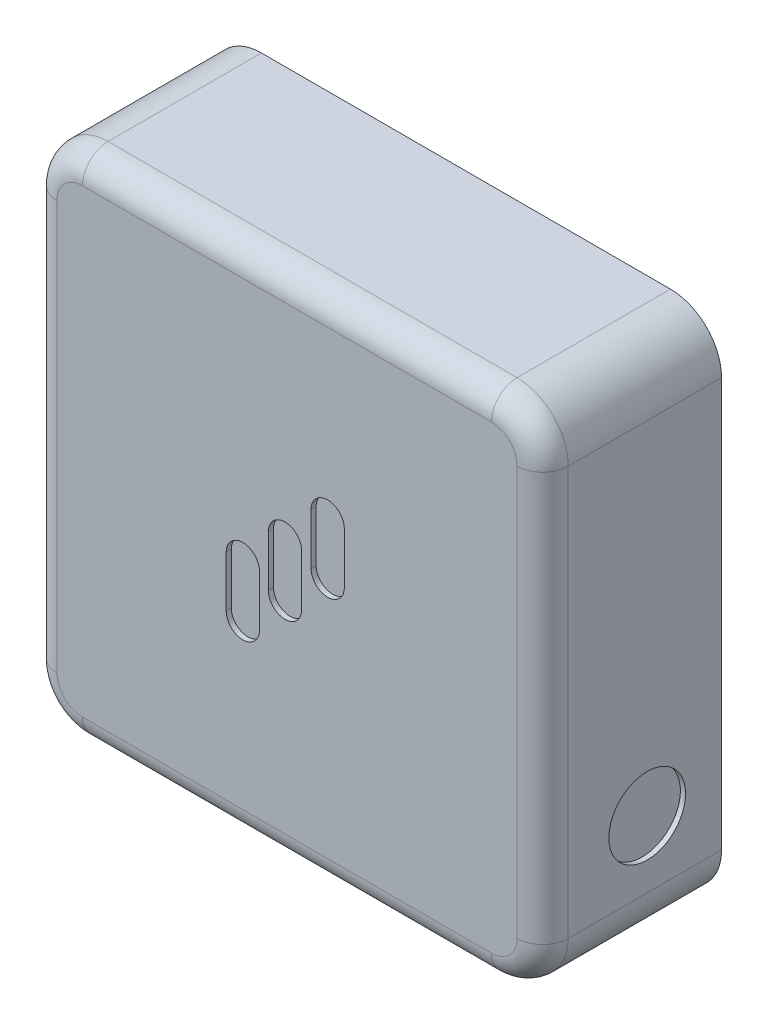
ISO-10303-21;
HEADER;
FILE_DESCRIPTION(('STEP AP214'),'2;1');
FILE_NAME('part.step','',(''),(''),'','','');
FILE_SCHEMA(('AUTOMOTIVE_DESIGN { 1 0 10303 214 1 1 1 1 }'));
ENDSEC;
DATA;
#1=APPLICATION_CONTEXT('core data for automotive mechanical design processes');
#2=APPLICATION_PROTOCOL_DEFINITION('international standard','automotive_design',2000,#1);
#3=PRODUCT_CONTEXT('',#1,'mechanical');
#4=PRODUCT('Part','Part','',(#3));
#5=PRODUCT_RELATED_PRODUCT_CATEGORY('part','',(#4));
#6=PRODUCT_DEFINITION_FORMATION('','',#4);
#7=PRODUCT_DEFINITION_CONTEXT('part definition',#1,'design');
#8=PRODUCT_DEFINITION('design','',#6,#7);
#9=PRODUCT_DEFINITION_SHAPE('','',#8);
#10=(LENGTH_UNIT() NAMED_UNIT(*) SI_UNIT(.MILLI.,.METRE.));
#11=(NAMED_UNIT(*) PLANE_ANGLE_UNIT() SI_UNIT($,.RADIAN.));
#12=(NAMED_UNIT(*) SI_UNIT($,.STERADIAN.) SOLID_ANGLE_UNIT());
#13=UNCERTAINTY_MEASURE_WITH_UNIT(LENGTH_MEASURE(1.E-05),#10,'distance_accuracy_value','');
#14=(GEOMETRIC_REPRESENTATION_CONTEXT(3) GLOBAL_UNCERTAINTY_ASSIGNED_CONTEXT((#13)) GLOBAL_UNIT_ASSIGNED_CONTEXT((#10,
#11,#12)) REPRESENTATION_CONTEXT('',''));
#15=CARTESIAN_POINT('',(0.,0.,0.));
#16=DIRECTION('',(0.,0.,1.));
#17=DIRECTION('',(1.,0.,0.));
#18=AXIS2_PLACEMENT_3D('',#15,#16,#17);
#19=CARTESIAN_POINT('',(-57.3786149605487,26.1554150628127,35.));
#20=DIRECTION('',(1.,0.,0.));
#21=DIRECTION('',(0.,1.,0.));
#22=AXIS2_PLACEMENT_3D('',#19,#20,#21);
#23=PLANE('',#22);
#24=DIRECTION('',(0.,0.,-1.));
#25=VECTOR('',#24,1.);
#26=CARTESIAN_POINT('',(-57.3786149605487,-63.8445849371873,35.));
#27=LINE('',#26,#25);
#28=CARTESIAN_POINT('',(-57.3786149605487,-63.8445849371873,0.));
#29=VERTEX_POINT('',#28);
#30=CARTESIAN_POINT('',(-57.3786149605487,-63.8445849371873,30.));
#31=VERTEX_POINT('',#30);
#32=EDGE_CURVE('E394',#29,#31,#27,.F.);
#33=ORIENTED_EDGE('',*,*,#32,.T.);
#34=DIRECTION('',(0.,-1.,0.));
#35=VECTOR('',#34,1.);
#36=CARTESIAN_POINT('',(-57.3786149605487,16.1554150628127,30.));
#37=LINE('',#36,#35);
#38=CARTESIAN_POINT('',(-57.3786149605487,16.1554150628127,30.));
#39=VERTEX_POINT('',#38);
#40=EDGE_CURVE('E434',#31,#39,#37,.F.);
#41=ORIENTED_EDGE('',*,*,#40,.T.);
#42=DIRECTION('',(0.,0.,-1.));
#43=VECTOR('',#42,1.);
#44=CARTESIAN_POINT('',(-57.3786149605487,16.1554150628127,0.));
#45=LINE('',#44,#43);
#46=CARTESIAN_POINT('',(-57.3786149605487,16.1554150628127,0.));
#47=VERTEX_POINT('',#46);
#48=EDGE_CURVE('E391',#39,#47,#45,.T.);
#49=ORIENTED_EDGE('',*,*,#48,.T.);
#50=DIRECTION('',(0.,-1.,0.));
#51=VECTOR('',#50,1.);
#52=CARTESIAN_POINT('',(-57.3786149605487,26.1554150628127,0.));
#53=LINE('',#52,#51);
#54=EDGE_CURVE('E349',#47,#29,#53,.T.);
#55=ORIENTED_EDGE('',*,*,#54,.T.);
#56=EDGE_LOOP('',(#33,#41,#49,#55));
#57=FACE_BOUND('',#56,.T.);
#58=ADVANCED_FACE('F41',(#57),#23,.F.);
#59=CARTESIAN_POINT('',(-57.3786149605487,-73.8445849371873,35.));
#60=DIRECTION('',(0.,1.,0.));
#61=DIRECTION('',(0.,0.,1.));
#62=AXIS2_PLACEMENT_3D('',#59,#60,#61);
#63=PLANE('',#62);
#64=DIRECTION('',(0.,0.,-1.));
#65=VECTOR('',#64,1.);
#66=CARTESIAN_POINT('',(32.6213850394513,-73.8445849371873,35.));
#67=LINE('',#66,#65);
#68=CARTESIAN_POINT('',(32.6213850394513,-73.8445849371873,0.));
#69=VERTEX_POINT('',#68);
#70=CARTESIAN_POINT('',(32.6213850394513,-73.8445849371873,30.));
#71=VERTEX_POINT('',#70);
#72=EDGE_CURVE('E387',#69,#71,#67,.F.);
#73=ORIENTED_EDGE('',*,*,#72,.T.);
#74=DIRECTION('',(1.,0.,0.));
#75=VECTOR('',#74,1.);
#76=CARTESIAN_POINT('',(-47.3786149605487,-73.8445849371873,30.));
#77=LINE('',#76,#75);
#78=CARTESIAN_POINT('',(-47.3786149605487,-73.8445849371873,30.));
#79=VERTEX_POINT('',#78);
#80=EDGE_CURVE('E11',#71,#79,#77,.F.);
#81=ORIENTED_EDGE('',*,*,#80,.T.);
#82=DIRECTION('',(0.,0.,-1.));
#83=VECTOR('',#82,1.);
#84=CARTESIAN_POINT('',(-47.3786149605487,-73.8445849371873,35.));
#85=LINE('',#84,#83);
#86=CARTESIAN_POINT('',(-47.3786149605487,-73.8445849371873,0.));
#87=VERTEX_POINT('',#86);
#88=EDGE_CURVE('E384',#79,#87,#85,.T.);
#89=ORIENTED_EDGE('',*,*,#88,.T.);
#90=DIRECTION('',(1.,0.,0.));
#91=VECTOR('',#90,1.);
#92=CARTESIAN_POINT('',(-57.3786149605487,-73.8445849371873,0.));
#93=LINE('',#92,#91);
#94=EDGE_CURVE('E353',#87,#69,#93,.T.);
#95=ORIENTED_EDGE('',*,*,#94,.T.);
#96=EDGE_LOOP('',(#73,#81,#89,#95));
#97=FACE_BOUND('',#96,.T.);
#98=ADVANCED_FACE('F536',(#97),#63,.F.);
#99=CARTESIAN_POINT('',(42.6213850394513,26.1554150628127,35.));
#100=DIRECTION('',(1.,0.,0.));
#101=DIRECTION('',(0.,1.,0.));
#102=AXIS2_PLACEMENT_3D('',#99,#100,#101);
#103=PLANE('',#102);
#104=CARTESIAN_POINT('',(42.6213850394513,-50.7845466337328,14.5503691573125));
#105=DIRECTION('',(1.,0.,0.));
#106=DIRECTION('',(0.,1.,0.));
#107=AXIS2_PLACEMENT_3D('',#104,#105,#106);
#108=CIRCLE('',#107,7.5);
#109=CARTESIAN_POINT('',(42.6213850394513,-43.2845466337328,14.5503691573125));
#110=VERTEX_POINT('',#109);
#111=EDGE_CURVE('E250',#110,#110,#108,.T.);
#112=ORIENTED_EDGE('',*,*,#111,.F.);
#113=EDGE_LOOP('',(#112));
#114=FACE_BOUND('',#113,.T.);
#115=DIRECTION('',(0.,0.,-1.));
#116=VECTOR('',#115,1.);
#117=CARTESIAN_POINT('',(42.6213850394513,16.1554150628127,35.));
#118=LINE('',#117,#116);
#119=CARTESIAN_POINT('',(42.6213850394513,16.1554150628127,0.));
#120=VERTEX_POINT('',#119);
#121=CARTESIAN_POINT('',(42.6213850394513,16.1554150628127,30.));
#122=VERTEX_POINT('',#121);
#123=EDGE_CURVE('E365',#120,#122,#118,.F.);
#124=ORIENTED_EDGE('',*,*,#123,.T.);
#125=DIRECTION('',(0.,-1.,0.));
#126=VECTOR('',#125,1.);
#127=CARTESIAN_POINT('',(42.6213850394513,26.1554150628127,30.));
#128=LINE('',#127,#126);
#129=CARTESIAN_POINT('',(42.6213850394513,-63.8445849371873,30.));
#130=VERTEX_POINT('',#129);
#131=EDGE_CURVE('E446',#122,#130,#128,.T.);
#132=ORIENTED_EDGE('',*,*,#131,.T.);
#133=DIRECTION('',(0.,0.,-1.));
#134=VECTOR('',#133,1.);
#135=CARTESIAN_POINT('',(42.6213850394513,-63.8445849371873,0.));
#136=LINE('',#135,#134);
#137=CARTESIAN_POINT('',(42.6213850394513,-63.8445849371873,0.));
#138=VERTEX_POINT('',#137);
#139=EDGE_CURVE('E369',#130,#138,#136,.T.);
#140=ORIENTED_EDGE('',*,*,#139,.T.);
#141=DIRECTION('',(0.,-1.,0.));
#142=VECTOR('',#141,1.);
#143=CARTESIAN_POINT('',(42.6213850394513,26.1554150628127,0.));
#144=LINE('',#143,#142);
#145=EDGE_CURVE('E357',#120,#138,#144,.T.);
#146=ORIENTED_EDGE('',*,*,#145,.F.);
#147=EDGE_LOOP('',(#124,#132,#140,#146));
#148=FACE_BOUND('',#147,.T.);
#149=ADVANCED_FACE('F496',(#114,#148),#103,.T.);
#150=CARTESIAN_POINT('',(-57.3786149605487,26.1554150628127,35.));
#151=DIRECTION('',(0.,1.,0.));
#152=DIRECTION('',(0.,0.,1.));
#153=AXIS2_PLACEMENT_3D('',#150,#151,#152);
#154=PLANE('',#153);
#155=DIRECTION('',(0.,0.,-1.));
#156=VECTOR('',#155,1.);
#157=CARTESIAN_POINT('',(-47.3786149605487,26.1554150628127,35.));
#158=LINE('',#157,#156);
#159=CARTESIAN_POINT('',(-47.3786149605487,26.1554150628127,0.));
#160=VERTEX_POINT('',#159);
#161=CARTESIAN_POINT('',(-47.3786149605487,26.1554150628127,30.));
#162=VERTEX_POINT('',#161);
#163=EDGE_CURVE('E401',#160,#162,#158,.F.);
#164=ORIENTED_EDGE('',*,*,#163,.T.);
#165=DIRECTION('',(1.,0.,0.));
#166=VECTOR('',#165,1.);
#167=CARTESIAN_POINT('',(-57.3786149605487,26.1554150628127,30.));
#168=LINE('',#167,#166);
#169=CARTESIAN_POINT('',(32.6213850394513,26.1554150628127,30.));
#170=VERTEX_POINT('',#169);
#171=EDGE_CURVE('E440',#162,#170,#168,.T.);
#172=ORIENTED_EDGE('',*,*,#171,.T.);
#173=DIRECTION('',(0.,0.,-1.));
#174=VECTOR('',#173,1.);
#175=CARTESIAN_POINT('',(32.6213850394513,26.1554150628127,35.));
#176=LINE('',#175,#174);
#177=CARTESIAN_POINT('',(32.6213850394513,26.1554150628127,0.));
#178=VERTEX_POINT('',#177);
#179=EDGE_CURVE('E398',#170,#178,#176,.T.);
#180=ORIENTED_EDGE('',*,*,#179,.T.);
#181=DIRECTION('',(1.,0.,0.));
#182=VECTOR('',#181,1.);
#183=CARTESIAN_POINT('',(-57.3786149605487,26.1554150628127,0.));
#184=LINE('',#183,#182);
#185=EDGE_CURVE('E361',#160,#178,#184,.T.);
#186=ORIENTED_EDGE('',*,*,#185,.F.);
#187=EDGE_LOOP('',(#164,#172,#180,#186));
#188=FACE_BOUND('',#187,.T.);
#189=ADVANCED_FACE('F507',(#188),#154,.T.);
#190=CARTESIAN_POINT('',(0.,0.,35.));
#191=DIRECTION('',(0.,0.,1.));
#192=DIRECTION('',(1.,0.,0.));
#193=AXIS2_PLACEMENT_3D('',#190,#191,#192);
#194=PLANE('',#193);
#195=CARTESIAN_POINT('',(-16.0178897561953,-36.8220618232502,35.));
#196=DIRECTION('',(0.,0.,1.));
#197=DIRECTION('',(1.,0.,0.));
#198=AXIS2_PLACEMENT_3D('',#195,#196,#197);
#199=CIRCLE('',#198,3.25587240874136);
#200=CARTESIAN_POINT('',(-19.2737621649367,-36.8220618232502,35.));
#201=VERTEX_POINT('',#200);
#202=CARTESIAN_POINT('',(-12.762017347454,-36.8220618232502,35.));
#203=VERTEX_POINT('',#202);
#204=EDGE_CURVE('E59',#201,#203,#199,.T.);
#205=ORIENTED_EDGE('',*,*,#204,.F.);
#206=DIRECTION('',(0.,-1.,0.));
#207=VECTOR('',#206,1.);
#208=CARTESIAN_POINT('',(-19.2737621649367,-36.8220618232502,35.));
#209=LINE('',#208,#207);
#210=CARTESIAN_POINT('',(-19.2737621649367,-26.8511288793585,35.));
#211=VERTEX_POINT('',#210);
#212=EDGE_CURVE('E227',#211,#201,#209,.T.);
#213=ORIENTED_EDGE('',*,*,#212,.F.);
#214=CARTESIAN_POINT('',(-16.0178897561953,-26.8511288793585,35.));
#215=DIRECTION('',(0.,0.,1.));
#216=DIRECTION('',(1.,0.,0.));
#217=AXIS2_PLACEMENT_3D('',#214,#215,#216);
#218=CIRCLE('',#217,3.25587240874137);
#219=CARTESIAN_POINT('',(-12.762017347454,-26.8511288793585,35.));
#220=VERTEX_POINT('',#219);
#221=EDGE_CURVE('E231',#220,#211,#218,.T.);
#222=ORIENTED_EDGE('',*,*,#221,.F.);
#223=DIRECTION('',(0.,1.,0.));
#224=VECTOR('',#223,1.);
#225=CARTESIAN_POINT('',(-12.762017347454,-36.8220618232502,35.));
#226=LINE('',#225,#224);
#227=EDGE_CURVE('E240',#203,#220,#226,.T.);
#228=ORIENTED_EDGE('',*,*,#227,.F.);
#229=EDGE_LOOP('',(#205,#213,#222,#228));
#230=FACE_BOUND('',#229,.T.);
#231=CARTESIAN_POINT('',(-7.77189907290697,-29.2242948910743,35.));
#232=DIRECTION('',(0.,0.,1.));
#233=DIRECTION('',(1.,0.,0.));
#234=AXIS2_PLACEMENT_3D('',#231,#232,#233);
#235=CIRCLE('',#234,3.25587240874136);
#236=CARTESIAN_POINT('',(-11.0277714816483,-29.2242948910743,35.));
#237=VERTEX_POINT('',#236);
#238=CARTESIAN_POINT('',(-4.51602666416561,-29.2242948910743,35.));
#239=VERTEX_POINT('',#238);
#240=EDGE_CURVE('E67',#237,#239,#235,.T.);
#241=ORIENTED_EDGE('',*,*,#240,.F.);
#242=DIRECTION('',(0.,-1.,0.));
#243=VECTOR('',#242,1.);
#244=CARTESIAN_POINT('',(-11.0277714816483,-29.2242948910743,35.));
#245=LINE('',#244,#243);
#246=CARTESIAN_POINT('',(-11.0277714816483,-19.2533619471825,35.));
#247=VERTEX_POINT('',#246);
#248=EDGE_CURVE('E261',#247,#237,#245,.T.);
#249=ORIENTED_EDGE('',*,*,#248,.F.);
#250=CARTESIAN_POINT('',(-7.77189907290697,-19.2533619471825,35.));
#251=DIRECTION('',(0.,0.,1.));
#252=DIRECTION('',(1.,0.,0.));
#253=AXIS2_PLACEMENT_3D('',#250,#251,#252);
#254=CIRCLE('',#253,3.25587240874136);
#255=CARTESIAN_POINT('',(-4.51602666416561,-19.2533619471825,35.));
#256=VERTEX_POINT('',#255);
#257=EDGE_CURVE('E281',#256,#247,#254,.T.);
#258=ORIENTED_EDGE('',*,*,#257,.F.);
#259=DIRECTION('',(0.,1.,0.));
#260=VECTOR('',#259,1.);
#261=CARTESIAN_POINT('',(-4.51602666416561,-29.2242948910743,35.));
#262=LINE('',#261,#260);
#263=EDGE_CURVE('E276',#239,#256,#262,.T.);
#264=ORIENTED_EDGE('',*,*,#263,.F.);
#265=EDGE_LOOP('',(#241,#249,#258,#264));
#266=FACE_BOUND('',#265,.T.);
#267=CARTESIAN_POINT('',(0.574131194479374,-21.3115149364212,35.));
#268=DIRECTION('',(0.,0.,1.));
#269=DIRECTION('',(1.,0.,0.));
#270=AXIS2_PLACEMENT_3D('',#267,#268,#269);
#271=CIRCLE('',#270,3.25587240874137);
#272=CARTESIAN_POINT('',(-2.681741214262,-21.3115149364212,35.));
#273=VERTEX_POINT('',#272);
#274=CARTESIAN_POINT('',(3.83000360322075,-21.3115149364212,35.));
#275=VERTEX_POINT('',#274);
#276=EDGE_CURVE('E316',#273,#275,#271,.T.);
#277=ORIENTED_EDGE('',*,*,#276,.F.);
#278=DIRECTION('',(0.,-1.,0.));
#279=VECTOR('',#278,1.);
#280=CARTESIAN_POINT('',(-2.681741214262,-21.3115149364212,35.));
#281=LINE('',#280,#279);
#282=CARTESIAN_POINT('',(-2.681741214262,-11.3405819925295,35.));
#283=VERTEX_POINT('',#282);
#284=EDGE_CURVE('E303',#283,#273,#281,.T.);
#285=ORIENTED_EDGE('',*,*,#284,.F.);
#286=CARTESIAN_POINT('',(0.574131194479374,-11.3405819925295,35.));
#287=DIRECTION('',(0.,0.,1.));
#288=DIRECTION('',(1.,0.,0.));
#289=AXIS2_PLACEMENT_3D('',#286,#287,#288);
#290=CIRCLE('',#289,3.25587240874137);
#291=CARTESIAN_POINT('',(3.83000360322075,-11.3405819925295,35.));
#292=VERTEX_POINT('',#291);
#293=EDGE_CURVE('E323',#292,#283,#290,.T.);
#294=ORIENTED_EDGE('',*,*,#293,.F.);
#295=DIRECTION('',(0.,1.,0.));
#296=VECTOR('',#295,1.);
#297=CARTESIAN_POINT('',(3.83000360322075,-21.3115149364212,35.));
#298=LINE('',#297,#296);
#299=EDGE_CURVE('E319',#275,#292,#298,.T.);
#300=ORIENTED_EDGE('',*,*,#299,.F.);
#301=EDGE_LOOP('',(#277,#285,#294,#300));
#302=FACE_BOUND('',#301,.T.);
#303=DIRECTION('',(0.,-1.,0.));
#304=VECTOR('',#303,1.);
#305=CARTESIAN_POINT('',(-52.3786149605487,-63.8445849371873,35.));
#306=LINE('',#305,#304);
#307=CARTESIAN_POINT('',(-52.3786149605487,16.1554150628127,35.));
#308=VERTEX_POINT('',#307);
#309=CARTESIAN_POINT('',(-52.3786149605487,-63.8445849371873,35.));
#310=VERTEX_POINT('',#309);
#311=EDGE_CURVE('E423',#308,#310,#306,.T.);
#312=ORIENTED_EDGE('',*,*,#311,.T.);
#313=CARTESIAN_POINT('',(-47.3786149605487,-63.8445849371873,35.));
#314=DIRECTION('',(0.,0.,1.));
#315=DIRECTION('',(1.,0.,0.));
#316=AXIS2_PLACEMENT_3D('',#313,#314,#315);
#317=CIRCLE('',#316,5.);
#318=CARTESIAN_POINT('',(-47.3786149605487,-68.8445849371873,35.));
#319=VERTEX_POINT('',#318);
#320=EDGE_CURVE('E426',#310,#319,#317,.T.);
#321=ORIENTED_EDGE('',*,*,#320,.T.);
#322=DIRECTION('',(1.,0.,0.));
#323=VECTOR('',#322,1.);
#324=CARTESIAN_POINT('',(32.6213850394513,-68.8445849371873,35.));
#325=LINE('',#324,#323);
#326=CARTESIAN_POINT('',(32.6213850394513,-68.8445849371873,35.));
#327=VERTEX_POINT('',#326);
#328=EDGE_CURVE('E405',#319,#327,#325,.T.);
#329=ORIENTED_EDGE('',*,*,#328,.T.);
#330=CARTESIAN_POINT('',(32.6213850394513,-63.8445849371873,35.));
#331=DIRECTION('',(0.,0.,1.));
#332=DIRECTION('',(1.,0.,0.));
#333=AXIS2_PLACEMENT_3D('',#330,#331,#332);
#334=CIRCLE('',#333,5.);
#335=CARTESIAN_POINT('',(37.6213850394513,-63.8445849371873,35.));
#336=VERTEX_POINT('',#335);
#337=EDGE_CURVE('E408',#327,#336,#334,.T.);
#338=ORIENTED_EDGE('',*,*,#337,.T.);
#339=DIRECTION('',(0.,-1.,0.));
#340=VECTOR('',#339,1.);
#341=CARTESIAN_POINT('',(37.6213850394513,0.,35.));
#342=LINE('',#341,#340);
#343=CARTESIAN_POINT('',(37.6213850394513,16.1554150628127,35.));
#344=VERTEX_POINT('',#343);
#345=EDGE_CURVE('E411',#336,#344,#342,.F.);
#346=ORIENTED_EDGE('',*,*,#345,.T.);
#347=CARTESIAN_POINT('',(32.6213850394513,16.1554150628127,35.));
#348=DIRECTION('',(0.,0.,1.));
#349=DIRECTION('',(1.,0.,0.));
#350=AXIS2_PLACEMENT_3D('',#347,#348,#349);
#351=CIRCLE('',#350,5.);
#352=CARTESIAN_POINT('',(32.6213850394513,21.1554150628127,35.));
#353=VERTEX_POINT('',#352);
#354=EDGE_CURVE('E414',#344,#353,#351,.T.);
#355=ORIENTED_EDGE('',*,*,#354,.T.);
#356=DIRECTION('',(1.,0.,0.));
#357=VECTOR('',#356,1.);
#358=CARTESIAN_POINT('',(0.,21.1554150628127,35.));
#359=LINE('',#358,#357);
#360=CARTESIAN_POINT('',(-47.3786149605487,21.1554150628127,35.));
#361=VERTEX_POINT('',#360);
#362=EDGE_CURVE('E417',#353,#361,#359,.F.);
#363=ORIENTED_EDGE('',*,*,#362,.T.);
#364=CARTESIAN_POINT('',(-47.3786149605487,16.1554150628127,35.));
#365=DIRECTION('',(0.,0.,1.));
#366=DIRECTION('',(1.,0.,0.));
#367=AXIS2_PLACEMENT_3D('',#364,#365,#366);
#368=CIRCLE('',#367,5.);
#369=EDGE_CURVE('E420',#361,#308,#368,.T.);
#370=ORIENTED_EDGE('',*,*,#369,.T.);
#371=EDGE_LOOP('',(#312,#321,#329,#338,#346,#355,#363,#370));
#372=FACE_BOUND('',#371,.T.);
#373=ADVANCED_FACE('F523',(#230,#266,#302,#372),#194,.T.);
#374=CARTESIAN_POINT('',(0.,0.,0.));
#375=DIRECTION('',(0.,0.,1.));
#376=DIRECTION('',(1.,0.,0.));
#377=AXIS2_PLACEMENT_3D('',#374,#375,#376);
#378=PLANE('',#377);
#379=ORIENTED_EDGE('',*,*,#145,.T.);
#380=CARTESIAN_POINT('',(32.6213850394513,-63.8445849371873,0.));
#381=DIRECTION('',(0.,0.,1.));
#382=DIRECTION('',(1.,0.,0.));
#383=AXIS2_PLACEMENT_3D('',#380,#381,#382);
#384=CIRCLE('',#383,10.);
#385=EDGE_CURVE('E381',#138,#69,#384,.F.);
#386=ORIENTED_EDGE('',*,*,#385,.T.);
#387=ORIENTED_EDGE('',*,*,#94,.F.);
#388=CARTESIAN_POINT('',(-47.3786149605487,-63.8445849371873,0.));
#389=DIRECTION('',(0.,0.,1.));
#390=DIRECTION('',(1.,0.,0.));
#391=AXIS2_PLACEMENT_3D('',#388,#389,#390);
#392=CIRCLE('',#391,10.);
#393=EDGE_CURVE('E378',#87,#29,#392,.F.);
#394=ORIENTED_EDGE('',*,*,#393,.T.);
#395=ORIENTED_EDGE('',*,*,#54,.F.);
#396=CARTESIAN_POINT('',(-47.3786149605487,16.1554150628127,0.));
#397=DIRECTION('',(0.,0.,1.));
#398=DIRECTION('',(1.,0.,0.));
#399=AXIS2_PLACEMENT_3D('',#396,#397,#398);
#400=CIRCLE('',#399,10.);
#401=EDGE_CURVE('E375',#47,#160,#400,.F.);
#402=ORIENTED_EDGE('',*,*,#401,.T.);
#403=ORIENTED_EDGE('',*,*,#185,.T.);
#404=CARTESIAN_POINT('',(32.6213850394513,16.1554150628127,0.));
#405=DIRECTION('',(0.,0.,1.));
#406=DIRECTION('',(1.,0.,0.));
#407=AXIS2_PLACEMENT_3D('',#404,#405,#406);
#408=CIRCLE('',#407,10.);
#409=EDGE_CURVE('E372',#178,#120,#408,.F.);
#410=ORIENTED_EDGE('',*,*,#409,.T.);
#411=EDGE_LOOP('',(#379,#386,#387,#394,#395,#402,#403,#410));
#412=FACE_BOUND('',#411,.T.);
#413=ADVANCED_FACE('F500',(#412),#378,.F.);
#414=CARTESIAN_POINT('',(32.6213850394513,-63.8445849371873,35.));
#415=DIRECTION('',(0.,0.,1.));
#416=DIRECTION('',(1.,0.,0.));
#417=AXIS2_PLACEMENT_3D('',#414,#415,#416);
#418=CYLINDRICAL_SURFACE('',#417,10.);
#419=ORIENTED_EDGE('',*,*,#139,.F.);
#420=CARTESIAN_POINT('',(32.6213850394513,-63.8445849371873,30.));
#421=DIRECTION('',(0.,0.,1.));
#422=DIRECTION('',(1.,0.,0.));
#423=AXIS2_PLACEMENT_3D('',#420,#421,#422);
#424=CIRCLE('',#423,10.);
#425=EDGE_CURVE('E51',#130,#71,#424,.F.);
#426=ORIENTED_EDGE('',*,*,#425,.T.);
#427=ORIENTED_EDGE('',*,*,#72,.F.);
#428=ORIENTED_EDGE('',*,*,#385,.F.);
#429=EDGE_LOOP('',(#419,#426,#427,#428));
#430=FACE_BOUND('',#429,.T.);
#431=ADVANCED_FACE('F534',(#430),#418,.T.);
#432=CARTESIAN_POINT('',(-47.3786149605487,-63.8445849371873,35.));
#433=DIRECTION('',(0.,0.,-1.));
#434=DIRECTION('',(-1.,0.,0.));
#435=AXIS2_PLACEMENT_3D('',#432,#433,#434);
#436=CYLINDRICAL_SURFACE('',#435,10.);
#437=ORIENTED_EDGE('',*,*,#88,.F.);
#438=CARTESIAN_POINT('',(-47.3786149605487,-63.8445849371873,30.));
#439=DIRECTION('',(0.,0.,1.));
#440=DIRECTION('',(1.,0.,0.));
#441=AXIS2_PLACEMENT_3D('',#438,#439,#440);
#442=CIRCLE('',#441,10.);
#443=EDGE_CURVE('E430',#79,#31,#442,.F.);
#444=ORIENTED_EDGE('',*,*,#443,.T.);
#445=ORIENTED_EDGE('',*,*,#32,.F.);
#446=ORIENTED_EDGE('',*,*,#393,.F.);
#447=EDGE_LOOP('',(#437,#444,#445,#446));
#448=FACE_BOUND('',#447,.T.);
#449=ADVANCED_FACE('F542',(#448),#436,.T.);
#450=CARTESIAN_POINT('',(-47.3786149605487,16.1554150628127,35.));
#451=DIRECTION('',(0.,0.,1.));
#452=DIRECTION('',(1.,0.,0.));
#453=AXIS2_PLACEMENT_3D('',#450,#451,#452);
#454=CYLINDRICAL_SURFACE('',#453,10.);
#455=ORIENTED_EDGE('',*,*,#48,.F.);
#456=CARTESIAN_POINT('',(-47.3786149605487,16.1554150628127,30.));
#457=DIRECTION('',(0.,0.,1.));
#458=DIRECTION('',(1.,0.,0.));
#459=AXIS2_PLACEMENT_3D('',#456,#457,#458);
#460=CIRCLE('',#459,10.);
#461=EDGE_CURVE('E437',#39,#162,#460,.F.);
#462=ORIENTED_EDGE('',*,*,#461,.T.);
#463=ORIENTED_EDGE('',*,*,#163,.F.);
#464=ORIENTED_EDGE('',*,*,#401,.F.);
#465=EDGE_LOOP('',(#455,#462,#463,#464));
#466=FACE_BOUND('',#465,.T.);
#467=ADVANCED_FACE('F510',(#466),#454,.T.);
#468=CARTESIAN_POINT('',(32.6213850394513,16.1554150628127,35.));
#469=DIRECTION('',(0.,0.,-1.));
#470=DIRECTION('',(-1.,0.,0.));
#471=AXIS2_PLACEMENT_3D('',#468,#469,#470);
#472=CYLINDRICAL_SURFACE('',#471,10.);
#473=ORIENTED_EDGE('',*,*,#179,.F.);
#474=CARTESIAN_POINT('',(32.6213850394513,16.1554150628127,30.));
#475=DIRECTION('',(0.,0.,1.));
#476=DIRECTION('',(1.,0.,0.));
#477=AXIS2_PLACEMENT_3D('',#474,#475,#476);
#478=CIRCLE('',#477,10.);
#479=EDGE_CURVE('E443',#170,#122,#478,.F.);
#480=ORIENTED_EDGE('',*,*,#479,.T.);
#481=ORIENTED_EDGE('',*,*,#123,.F.);
#482=ORIENTED_EDGE('',*,*,#409,.F.);
#483=EDGE_LOOP('',(#473,#480,#481,#482));
#484=FACE_BOUND('',#483,.T.);
#485=ADVANCED_FACE('F492',(#484),#472,.T.);
#486=CARTESIAN_POINT('',(32.6213850394513,16.1554150628127,30.));
#487=DIRECTION('',(0.,0.,1.));
#488=DIRECTION('',(1.,0.,0.));
#489=AXIS2_PLACEMENT_3D('',#486,#487,#488);
#490=DEGENERATE_TOROIDAL_SURFACE('',#489,5.,5.,.T.);
#491=CARTESIAN_POINT('',(37.6213850394513,16.1554150628127,30.));
#492=DIRECTION('',(0.,-1.,0.));
#493=DIRECTION('',(0.,0.,-1.));
#494=AXIS2_PLACEMENT_3D('',#491,#492,#493);
#495=CIRCLE('',#494,5.);
#496=EDGE_CURVE('E471',#122,#344,#495,.T.);
#497=ORIENTED_EDGE('',*,*,#496,.F.);
#498=ORIENTED_EDGE('',*,*,#479,.F.);
#499=CARTESIAN_POINT('',(32.6213850394513,21.1554150628127,30.));
#500=DIRECTION('',(-1.,0.,0.));
#501=DIRECTION('',(0.,0.,1.));
#502=AXIS2_PLACEMENT_3D('',#499,#500,#501);
#503=CIRCLE('',#502,5.);
#504=EDGE_CURVE('E45',#353,#170,#503,.T.);
#505=ORIENTED_EDGE('',*,*,#504,.F.);
#506=ORIENTED_EDGE('',*,*,#354,.F.);
#507=EDGE_LOOP('',(#497,#498,#505,#506));
#508=FACE_BOUND('',#507,.T.);
#509=ADVANCED_FACE('F43',(#508),#490,.T.);
#510=CARTESIAN_POINT('',(-57.3786149605487,21.1554150628127,30.));
#511=DIRECTION('',(1.,0.,0.));
#512=DIRECTION('',(0.,0.,-1.));
#513=AXIS2_PLACEMENT_3D('',#510,#511,#512);
#514=CYLINDRICAL_SURFACE('',#513,5.);
#515=ORIENTED_EDGE('',*,*,#504,.T.);
#516=ORIENTED_EDGE('',*,*,#171,.F.);
#517=CARTESIAN_POINT('',(-47.3786149605487,21.1554150628127,30.));
#518=DIRECTION('',(-1.,0.,0.));
#519=DIRECTION('',(0.,0.,1.));
#520=AXIS2_PLACEMENT_3D('',#517,#518,#519);
#521=CIRCLE('',#520,5.);
#522=EDGE_CURVE('E468',#361,#162,#521,.T.);
#523=ORIENTED_EDGE('',*,*,#522,.F.);
#524=ORIENTED_EDGE('',*,*,#362,.F.);
#525=EDGE_LOOP('',(#515,#516,#523,#524));
#526=FACE_BOUND('',#525,.T.);
#527=ADVANCED_FACE('F484',(#526),#514,.T.);
#528=CARTESIAN_POINT('',(37.6213850394513,26.1554150628127,30.));
#529=DIRECTION('',(0.,-1.,0.));
#530=DIRECTION('',(1.,0.,0.));
#531=AXIS2_PLACEMENT_3D('',#528,#529,#530);
#532=CYLINDRICAL_SURFACE('',#531,5.);
#533=ORIENTED_EDGE('',*,*,#496,.T.);
#534=ORIENTED_EDGE('',*,*,#345,.F.);
#535=CARTESIAN_POINT('',(37.6213850394514,-63.8445849371873,30.));
#536=DIRECTION('',(0.,-1.,0.));
#537=DIRECTION('',(0.,0.,-1.));
#538=AXIS2_PLACEMENT_3D('',#535,#536,#537);
#539=CIRCLE('',#538,5.);
#540=EDGE_CURVE('E464',#130,#336,#539,.T.);
#541=ORIENTED_EDGE('',*,*,#540,.F.);
#542=ORIENTED_EDGE('',*,*,#131,.F.);
#543=EDGE_LOOP('',(#533,#534,#541,#542));
#544=FACE_BOUND('',#543,.T.);
#545=ADVANCED_FACE('F526',(#544),#532,.T.);
#546=CARTESIAN_POINT('',(-47.3786149605487,16.1554150628127,30.));
#547=DIRECTION('',(0.,0.,1.));
#548=DIRECTION('',(1.,0.,0.));
#549=AXIS2_PLACEMENT_3D('',#546,#547,#548);
#550=DEGENERATE_TOROIDAL_SURFACE('',#549,5.,5.,.T.);
#551=ORIENTED_EDGE('',*,*,#522,.T.);
#552=ORIENTED_EDGE('',*,*,#461,.F.);
#553=CARTESIAN_POINT('',(-52.3786149605487,16.1554150628127,30.));
#554=DIRECTION('',(0.,-1.,0.));
#555=DIRECTION('',(0.,0.,-1.));
#556=AXIS2_PLACEMENT_3D('',#553,#554,#555);
#557=CIRCLE('',#556,5.);
#558=EDGE_CURVE('E460',#308,#39,#557,.T.);
#559=ORIENTED_EDGE('',*,*,#558,.F.);
#560=ORIENTED_EDGE('',*,*,#369,.F.);
#561=EDGE_LOOP('',(#551,#552,#559,#560));
#562=FACE_BOUND('',#561,.T.);
#563=ADVANCED_FACE('F514',(#562),#550,.T.);
#564=CARTESIAN_POINT('',(32.6213850394513,-63.8445849371873,30.));
#565=DIRECTION('',(0.,0.,1.));
#566=DIRECTION('',(1.,0.,0.));
#567=AXIS2_PLACEMENT_3D('',#564,#565,#566);
#568=DEGENERATE_TOROIDAL_SURFACE('',#567,5.,5.,.T.);
#569=ORIENTED_EDGE('',*,*,#540,.T.);
#570=ORIENTED_EDGE('',*,*,#337,.F.);
#571=CARTESIAN_POINT('',(32.6213850394513,-68.8445849371873,30.));
#572=DIRECTION('',(-1.,0.,0.));
#573=DIRECTION('',(0.,0.,1.));
#574=AXIS2_PLACEMENT_3D('',#571,#572,#573);
#575=CIRCLE('',#574,5.);
#576=EDGE_CURVE('E456',#71,#327,#575,.T.);
#577=ORIENTED_EDGE('',*,*,#576,.F.);
#578=ORIENTED_EDGE('',*,*,#425,.F.);
#579=EDGE_LOOP('',(#569,#570,#577,#578));
#580=FACE_BOUND('',#579,.T.);
#581=ADVANCED_FACE('F529',(#580),#568,.T.);
#582=CARTESIAN_POINT('',(-52.3786149605487,0.,30.));
#583=DIRECTION('',(0.,1.,0.));
#584=DIRECTION('',(-1.,0.,0.));
#585=AXIS2_PLACEMENT_3D('',#582,#583,#584);
#586=CYLINDRICAL_SURFACE('',#585,5.);
#587=ORIENTED_EDGE('',*,*,#558,.T.);
#588=ORIENTED_EDGE('',*,*,#40,.F.);
#589=CARTESIAN_POINT('',(-52.3786149605487,-63.8445849371873,30.));
#590=DIRECTION('',(0.,-1.,0.));
#591=DIRECTION('',(0.,0.,-1.));
#592=AXIS2_PLACEMENT_3D('',#589,#590,#591);
#593=CIRCLE('',#592,5.);
#594=EDGE_CURVE('E453',#310,#31,#593,.T.);
#595=ORIENTED_EDGE('',*,*,#594,.F.);
#596=ORIENTED_EDGE('',*,*,#311,.F.);
#597=EDGE_LOOP('',(#587,#588,#595,#596));
#598=FACE_BOUND('',#597,.T.);
#599=ADVANCED_FACE('F519',(#598),#586,.T.);
#600=CARTESIAN_POINT('',(0.,-68.8445849371873,30.));
#601=DIRECTION('',(-1.,0.,0.));
#602=DIRECTION('',(0.,0.,1.));
#603=AXIS2_PLACEMENT_3D('',#600,#601,#602);
#604=CYLINDRICAL_SURFACE('',#603,5.);
#605=ORIENTED_EDGE('',*,*,#576,.T.);
#606=ORIENTED_EDGE('',*,*,#328,.F.);
#607=CARTESIAN_POINT('',(-47.3786149605487,-68.8445849371873,30.));
#608=DIRECTION('',(-1.,0.,0.));
#609=DIRECTION('',(0.,0.,1.));
#610=AXIS2_PLACEMENT_3D('',#607,#608,#609);
#611=CIRCLE('',#610,5.);
#612=EDGE_CURVE('E345',#79,#319,#611,.T.);
#613=ORIENTED_EDGE('',*,*,#612,.F.);
#614=ORIENTED_EDGE('',*,*,#80,.F.);
#615=EDGE_LOOP('',(#605,#606,#613,#614));
#616=FACE_BOUND('',#615,.T.);
#617=ADVANCED_FACE('F549',(#616),#604,.T.);
#618=CARTESIAN_POINT('',(-47.3786149605487,-63.8445849371873,30.));
#619=DIRECTION('',(0.,0.,1.));
#620=DIRECTION('',(1.,0.,0.));
#621=AXIS2_PLACEMENT_3D('',#618,#619,#620);
#622=DEGENERATE_TOROIDAL_SURFACE('',#621,5.,5.,.T.);
#623=ORIENTED_EDGE('',*,*,#594,.T.);
#624=ORIENTED_EDGE('',*,*,#443,.F.);
#625=ORIENTED_EDGE('',*,*,#612,.T.);
#626=ORIENTED_EDGE('',*,*,#320,.F.);
#627=EDGE_LOOP('',(#623,#624,#625,#626));
#628=FACE_BOUND('',#627,.T.);
#629=ADVANCED_FACE('F546',(#628),#622,.T.);
#630=CARTESIAN_POINT('',(41.6213850394514,-50.7845466337328,14.5503691573125));
#631=DIRECTION('',(1.,0.,0.));
#632=DIRECTION('',(0.,1.,0.));
#633=AXIS2_PLACEMENT_3D('',#630,#631,#632);
#634=CYLINDRICAL_SURFACE('',#633,7.5);
#635=CARTESIAN_POINT('',(41.6213850394514,-50.7845466337328,14.5503691573125));
#636=DIRECTION('',(1.,0.,0.));
#637=DIRECTION('',(0.,1.,0.));
#638=AXIS2_PLACEMENT_3D('',#635,#636,#637);
#639=CIRCLE('',#638,7.5);
#640=CARTESIAN_POINT('',(41.6213850394514,-43.2845466337328,14.5503691573125));
#641=VERTEX_POINT('',#640);
#642=EDGE_CURVE('E341',#641,#641,#639,.T.);
#643=ORIENTED_EDGE('',*,*,#642,.F.);
#644=EDGE_LOOP('',(#643));
#645=FACE_BOUND('',#644,.T.);
#646=ORIENTED_EDGE('',*,*,#111,.T.);
#647=EDGE_LOOP('',(#646));
#648=FACE_BOUND('',#647,.T.);
#649=ADVANCED_FACE('F556',(#645,#648),#634,.F.);
#650=CARTESIAN_POINT('',(41.6213850394514,-50.7845466337328,14.5503691573125));
#651=DIRECTION('',(1.,0.,0.));
#652=DIRECTION('',(0.,1.,0.));
#653=AXIS2_PLACEMENT_3D('',#650,#651,#652);
#654=PLANE('',#653);
#655=ORIENTED_EDGE('',*,*,#642,.T.);
#656=EDGE_LOOP('',(#655));
#657=FACE_BOUND('',#656,.T.);
#658=ADVANCED_FACE('F627',(#657),#654,.T.);
#659=CARTESIAN_POINT('',(0.574131194479374,-21.3115149364212,34.));
#660=DIRECTION('',(0.,0.,1.));
#661=DIRECTION('',(1.,0.,0.));
#662=AXIS2_PLACEMENT_3D('',#659,#660,#661);
#663=CYLINDRICAL_SURFACE('',#662,3.25587240874137);
#664=ORIENTED_EDGE('',*,*,#276,.T.);
#665=DIRECTION('',(0.,0.,1.));
#666=VECTOR('',#665,1.);
#667=CARTESIAN_POINT('',(3.83000360322075,-21.3115149364212,34.));
#668=LINE('',#667,#666);
#669=CARTESIAN_POINT('',(3.83000360322075,-21.3115149364212,34.));
#670=VERTEX_POINT('',#669);
#671=EDGE_CURVE('E315',#670,#275,#668,.T.);
#672=ORIENTED_EDGE('',*,*,#671,.F.);
#673=CARTESIAN_POINT('',(0.574131194479374,-21.3115149364212,34.));
#674=DIRECTION('',(0.,0.,1.));
#675=DIRECTION('',(1.,0.,0.));
#676=AXIS2_PLACEMENT_3D('',#673,#674,#675);
#677=CIRCLE('',#676,3.25587240874137);
#678=CARTESIAN_POINT('',(-2.681741214262,-21.3115149364212,34.));
#679=VERTEX_POINT('',#678);
#680=EDGE_CURVE('E298',#679,#670,#677,.T.);
#681=ORIENTED_EDGE('',*,*,#680,.F.);
#682=DIRECTION('',(0.,0.,1.));
#683=VECTOR('',#682,1.);
#684=CARTESIAN_POINT('',(-2.681741214262,-21.3115149364212,34.));
#685=LINE('',#684,#683);
#686=EDGE_CURVE('E277',#679,#273,#685,.T.);
#687=ORIENTED_EDGE('',*,*,#686,.T.);
#688=EDGE_LOOP('',(#664,#672,#681,#687));
#689=FACE_BOUND('',#688,.T.);
#690=ADVANCED_FACE('F637',(#689),#663,.F.);
#691=CARTESIAN_POINT('',(-2.681741214262,-21.3115149364212,34.));
#692=DIRECTION('',(-1.,0.,0.));
#693=DIRECTION('',(0.,0.,1.));
#694=AXIS2_PLACEMENT_3D('',#691,#692,#693);
#695=PLANE('',#694);
#696=ORIENTED_EDGE('',*,*,#284,.T.);
#697=ORIENTED_EDGE('',*,*,#686,.F.);
#698=DIRECTION('',(0.,-1.,0.));
#699=VECTOR('',#698,1.);
#700=CARTESIAN_POINT('',(-2.681741214262,-21.3115149364212,34.));
#701=LINE('',#700,#699);
#702=CARTESIAN_POINT('',(-2.681741214262,-11.3405819925295,34.));
#703=VERTEX_POINT('',#702);
#704=EDGE_CURVE('E311',#703,#679,#701,.T.);
#705=ORIENTED_EDGE('',*,*,#704,.F.);
#706=DIRECTION('',(0.,0.,1.));
#707=VECTOR('',#706,1.);
#708=CARTESIAN_POINT('',(-2.681741214262,-11.3405819925295,34.));
#709=LINE('',#708,#707);
#710=EDGE_CURVE('E332',#703,#283,#709,.T.);
#711=ORIENTED_EDGE('',*,*,#710,.T.);
#712=EDGE_LOOP('',(#696,#697,#705,#711));
#713=FACE_BOUND('',#712,.T.);
#714=ADVANCED_FACE('F658',(#713),#695,.F.);
#715=CARTESIAN_POINT('',(0.574131194479374,-11.3405819925295,34.));
#716=DIRECTION('',(0.,0.,1.));
#717=DIRECTION('',(1.,0.,0.));
#718=AXIS2_PLACEMENT_3D('',#715,#716,#717);
#719=CYLINDRICAL_SURFACE('',#718,3.25587240874137);
#720=ORIENTED_EDGE('',*,*,#293,.T.);
#721=ORIENTED_EDGE('',*,*,#710,.F.);
#722=CARTESIAN_POINT('',(0.574131194479374,-11.3405819925295,34.));
#723=DIRECTION('',(0.,0.,1.));
#724=DIRECTION('',(1.,0.,0.));
#725=AXIS2_PLACEMENT_3D('',#722,#723,#724);
#726=CIRCLE('',#725,3.25587240874137);
#727=CARTESIAN_POINT('',(3.83000360322075,-11.3405819925295,34.));
#728=VERTEX_POINT('',#727);
#729=EDGE_CURVE('E307',#728,#703,#726,.T.);
#730=ORIENTED_EDGE('',*,*,#729,.F.);
#731=DIRECTION('',(0.,0.,1.));
#732=VECTOR('',#731,1.);
#733=CARTESIAN_POINT('',(3.83000360322075,-11.3405819925295,34.));
#734=LINE('',#733,#732);
#735=EDGE_CURVE('E335',#728,#292,#734,.T.);
#736=ORIENTED_EDGE('',*,*,#735,.T.);
#737=EDGE_LOOP('',(#720,#721,#730,#736));
#738=FACE_BOUND('',#737,.T.);
#739=ADVANCED_FACE('F668',(#738),#719,.F.);
#740=CARTESIAN_POINT('',(3.83000360322075,-21.3115149364212,34.));
#741=DIRECTION('',(1.,0.,0.));
#742=DIRECTION('',(0.,0.,-1.));
#743=AXIS2_PLACEMENT_3D('',#740,#741,#742);
#744=PLANE('',#743);
#745=ORIENTED_EDGE('',*,*,#299,.T.);
#746=ORIENTED_EDGE('',*,*,#735,.F.);
#747=DIRECTION('',(0.,1.,0.));
#748=VECTOR('',#747,1.);
#749=CARTESIAN_POINT('',(3.83000360322075,-21.3115149364212,34.));
#750=LINE('',#749,#748);
#751=EDGE_CURVE('E302',#670,#728,#750,.T.);
#752=ORIENTED_EDGE('',*,*,#751,.F.);
#753=ORIENTED_EDGE('',*,*,#671,.T.);
#754=EDGE_LOOP('',(#745,#746,#752,#753));
#755=FACE_BOUND('',#754,.T.);
#756=ADVANCED_FACE('F678',(#755),#744,.F.);
#757=CARTESIAN_POINT('',(0.574131194479374,-21.3115149364212,34.));
#758=DIRECTION('',(0.,0.,1.));
#759=DIRECTION('',(1.,0.,0.));
#760=AXIS2_PLACEMENT_3D('',#757,#758,#759);
#761=PLANE('',#760);
#762=ORIENTED_EDGE('',*,*,#680,.T.);
#763=ORIENTED_EDGE('',*,*,#751,.T.);
#764=ORIENTED_EDGE('',*,*,#729,.T.);
#765=ORIENTED_EDGE('',*,*,#704,.T.);
#766=EDGE_LOOP('',(#762,#763,#764,#765));
#767=FACE_BOUND('',#766,.T.);
#768=ADVANCED_FACE('F688',(#767),#761,.T.);
#769=CARTESIAN_POINT('',(-7.77189907290697,-29.2242948910743,34.));
#770=DIRECTION('',(0.,0.,1.));
#771=DIRECTION('',(1.,0.,0.));
#772=AXIS2_PLACEMENT_3D('',#769,#770,#771);
#773=CYLINDRICAL_SURFACE('',#772,3.25587240874136);
#774=ORIENTED_EDGE('',*,*,#240,.T.);
#775=DIRECTION('',(0.,0.,1.));
#776=VECTOR('',#775,1.);
#777=CARTESIAN_POINT('',(-4.51602666416561,-29.2242948910743,34.));
#778=LINE('',#777,#776);
#779=CARTESIAN_POINT('',(-4.51602666416561,-29.2242948910743,34.));
#780=VERTEX_POINT('',#779);
#781=EDGE_CURVE('E273',#780,#239,#778,.T.);
#782=ORIENTED_EDGE('',*,*,#781,.F.);
#783=CARTESIAN_POINT('',(-7.77189907290697,-29.2242948910743,34.));
#784=DIRECTION('',(0.,0.,1.));
#785=DIRECTION('',(1.,0.,0.));
#786=AXIS2_PLACEMENT_3D('',#783,#784,#785);
#787=CIRCLE('',#786,3.25587240874136);
#788=CARTESIAN_POINT('',(-11.0277714816483,-29.2242948910743,34.));
#789=VERTEX_POINT('',#788);
#790=EDGE_CURVE('E256',#789,#780,#787,.T.);
#791=ORIENTED_EDGE('',*,*,#790,.F.);
#792=DIRECTION('',(0.,0.,1.));
#793=VECTOR('',#792,1.);
#794=CARTESIAN_POINT('',(-11.0277714816483,-29.2242948910743,34.));
#795=LINE('',#794,#793);
#796=EDGE_CURVE('E241',#789,#237,#795,.T.);
#797=ORIENTED_EDGE('',*,*,#796,.T.);
#798=EDGE_LOOP('',(#774,#782,#791,#797));
#799=FACE_BOUND('',#798,.T.);
#800=ADVANCED_FACE('F698',(#799),#773,.F.);
#801=CARTESIAN_POINT('',(-11.0277714816483,-29.2242948910743,34.));
#802=DIRECTION('',(-1.,0.,0.));
#803=DIRECTION('',(0.,0.,1.));
#804=AXIS2_PLACEMENT_3D('',#801,#802,#803);
#805=PLANE('',#804);
#806=ORIENTED_EDGE('',*,*,#248,.T.);
#807=ORIENTED_EDGE('',*,*,#796,.F.);
#808=DIRECTION('',(0.,-1.,0.));
#809=VECTOR('',#808,1.);
#810=CARTESIAN_POINT('',(-11.0277714816483,-29.2242948910743,34.));
#811=LINE('',#810,#809);
#812=CARTESIAN_POINT('',(-11.0277714816483,-19.2533619471825,34.));
#813=VERTEX_POINT('',#812);
#814=EDGE_CURVE('E269',#813,#789,#811,.T.);
#815=ORIENTED_EDGE('',*,*,#814,.F.);
#816=DIRECTION('',(0.,0.,1.));
#817=VECTOR('',#816,1.);
#818=CARTESIAN_POINT('',(-11.0277714816483,-19.2533619471825,34.));
#819=LINE('',#818,#817);
#820=EDGE_CURVE('E290',#813,#247,#819,.T.);
#821=ORIENTED_EDGE('',*,*,#820,.T.);
#822=EDGE_LOOP('',(#806,#807,#815,#821));
#823=FACE_BOUND('',#822,.T.);
#824=ADVANCED_FACE('F708',(#823),#805,.F.);
#825=CARTESIAN_POINT('',(-7.77189907290697,-19.2533619471825,34.));
#826=DIRECTION('',(0.,0.,1.));
#827=DIRECTION('',(1.,0.,0.));
#828=AXIS2_PLACEMENT_3D('',#825,#826,#827);
#829=CYLINDRICAL_SURFACE('',#828,3.25587240874136);
#830=ORIENTED_EDGE('',*,*,#257,.T.);
#831=ORIENTED_EDGE('',*,*,#820,.F.);
#832=CARTESIAN_POINT('',(-7.77189907290697,-19.2533619471825,34.));
#833=DIRECTION('',(0.,0.,1.));
#834=DIRECTION('',(1.,0.,0.));
#835=AXIS2_PLACEMENT_3D('',#832,#833,#834);
#836=CIRCLE('',#835,3.25587240874136);
#837=CARTESIAN_POINT('',(-4.51602666416561,-19.2533619471825,34.));
#838=VERTEX_POINT('',#837);
#839=EDGE_CURVE('E265',#838,#813,#836,.T.);
#840=ORIENTED_EDGE('',*,*,#839,.F.);
#841=DIRECTION('',(0.,0.,1.));
#842=VECTOR('',#841,1.);
#843=CARTESIAN_POINT('',(-4.51602666416561,-19.2533619471825,34.));
#844=LINE('',#843,#842);
#845=EDGE_CURVE('E293',#838,#256,#844,.T.);
#846=ORIENTED_EDGE('',*,*,#845,.T.);
#847=EDGE_LOOP('',(#830,#831,#840,#846));
#848=FACE_BOUND('',#847,.T.);
#849=ADVANCED_FACE('F717',(#848),#829,.F.);
#850=CARTESIAN_POINT('',(-4.51602666416561,-29.2242948910743,34.));
#851=DIRECTION('',(1.,0.,0.));
#852=DIRECTION('',(0.,0.,-1.));
#853=AXIS2_PLACEMENT_3D('',#850,#851,#852);
#854=PLANE('',#853);
#855=ORIENTED_EDGE('',*,*,#263,.T.);
#856=ORIENTED_EDGE('',*,*,#845,.F.);
#857=DIRECTION('',(0.,1.,0.));
#858=VECTOR('',#857,1.);
#859=CARTESIAN_POINT('',(-4.51602666416561,-29.2242948910743,34.));
#860=LINE('',#859,#858);
#861=EDGE_CURVE('E260',#780,#838,#860,.T.);
#862=ORIENTED_EDGE('',*,*,#861,.F.);
#863=ORIENTED_EDGE('',*,*,#781,.T.);
#864=EDGE_LOOP('',(#855,#856,#862,#863));
#865=FACE_BOUND('',#864,.T.);
#866=ADVANCED_FACE('F727',(#865),#854,.F.);
#867=CARTESIAN_POINT('',(-7.77189907290697,-29.2242948910743,34.));
#868=DIRECTION('',(0.,0.,1.));
#869=DIRECTION('',(1.,0.,0.));
#870=AXIS2_PLACEMENT_3D('',#867,#868,#869);
#871=PLANE('',#870);
#872=ORIENTED_EDGE('',*,*,#790,.T.);
#873=ORIENTED_EDGE('',*,*,#861,.T.);
#874=ORIENTED_EDGE('',*,*,#839,.T.);
#875=ORIENTED_EDGE('',*,*,#814,.T.);
#876=EDGE_LOOP('',(#872,#873,#874,#875));
#877=FACE_BOUND('',#876,.T.);
#878=ADVANCED_FACE('F737',(#877),#871,.T.);
#879=CARTESIAN_POINT('',(-16.0178897561953,-36.8220618232502,34.));
#880=DIRECTION('',(0.,0.,1.));
#881=DIRECTION('',(1.,0.,0.));
#882=AXIS2_PLACEMENT_3D('',#879,#880,#881);
#883=CYLINDRICAL_SURFACE('',#882,3.25587240874136);
#884=ORIENTED_EDGE('',*,*,#204,.T.);
#885=DIRECTION('',(0.,0.,1.));
#886=VECTOR('',#885,1.);
#887=CARTESIAN_POINT('',(-12.762017347454,-36.8220618232502,34.));
#888=LINE('',#887,#886);
#889=CARTESIAN_POINT('',(-12.762017347454,-36.8220618232502,34.));
#890=VERTEX_POINT('',#889);
#891=EDGE_CURVE('E202',#890,#203,#888,.T.);
#892=ORIENTED_EDGE('',*,*,#891,.F.);
#893=CARTESIAN_POINT('',(-16.0178897561953,-36.8220618232502,34.));
#894=DIRECTION('',(0.,0.,1.));
#895=DIRECTION('',(1.,0.,0.));
#896=AXIS2_PLACEMENT_3D('',#893,#894,#895);
#897=CIRCLE('',#896,3.25587240874136);
#898=CARTESIAN_POINT('',(-19.2737621649367,-36.8220618232502,34.));
#899=VERTEX_POINT('',#898);
#900=EDGE_CURVE('E206',#899,#890,#897,.T.);
#901=ORIENTED_EDGE('',*,*,#900,.F.);
#902=DIRECTION('',(0.,0.,1.));
#903=VECTOR('',#902,1.);
#904=CARTESIAN_POINT('',(-19.2737621649367,-36.8220618232502,34.));
#905=LINE('',#904,#903);
#906=EDGE_CURVE('E247',#899,#201,#905,.T.);
#907=ORIENTED_EDGE('',*,*,#906,.T.);
#908=EDGE_LOOP('',(#884,#892,#901,#907));
#909=FACE_BOUND('',#908,.T.);
#910=ADVANCED_FACE('F204',(#909),#883,.F.);
#911=CARTESIAN_POINT('',(-19.2737621649367,-36.8220618232502,34.));
#912=DIRECTION('',(-1.,0.,0.));
#913=DIRECTION('',(0.,-1.,0.));
#914=AXIS2_PLACEMENT_3D('',#911,#912,#913);
#915=PLANE('',#914);
#916=ORIENTED_EDGE('',*,*,#212,.T.);
#917=ORIENTED_EDGE('',*,*,#906,.F.);
#918=DIRECTION('',(0.,-1.,0.));
#919=VECTOR('',#918,1.);
#920=CARTESIAN_POINT('',(-19.2737621649367,-36.8220618232502,34.));
#921=LINE('',#920,#919);
#922=CARTESIAN_POINT('',(-19.2737621649367,-26.8511288793585,34.));
#923=VERTEX_POINT('',#922);
#924=EDGE_CURVE('E213',#923,#899,#921,.T.);
#925=ORIENTED_EDGE('',*,*,#924,.F.);
#926=DIRECTION('',(0.,0.,1.));
#927=VECTOR('',#926,1.);
#928=CARTESIAN_POINT('',(-19.2737621649367,-26.8511288793585,34.));
#929=LINE('',#928,#927);
#930=EDGE_CURVE('E251',#923,#211,#929,.T.);
#931=ORIENTED_EDGE('',*,*,#930,.T.);
#932=EDGE_LOOP('',(#916,#917,#925,#931));
#933=FACE_BOUND('',#932,.T.);
#934=ADVANCED_FACE('F756',(#933),#915,.F.);
#935=CARTESIAN_POINT('',(-16.0178897561953,-26.8511288793585,34.));
#936=DIRECTION('',(0.,0.,1.));
#937=DIRECTION('',(1.,0.,0.));
#938=AXIS2_PLACEMENT_3D('',#935,#936,#937);
#939=CYLINDRICAL_SURFACE('',#938,3.25587240874137);
#940=ORIENTED_EDGE('',*,*,#221,.T.);
#941=ORIENTED_EDGE('',*,*,#930,.F.);
#942=CARTESIAN_POINT('',(-16.0178897561953,-26.8511288793585,34.));
#943=DIRECTION('',(0.,0.,1.));
#944=DIRECTION('',(1.,0.,0.));
#945=AXIS2_PLACEMENT_3D('',#942,#943,#944);
#946=CIRCLE('',#945,3.25587240874137);
#947=CARTESIAN_POINT('',(-12.762017347454,-26.8511288793585,34.));
#948=VERTEX_POINT('',#947);
#949=EDGE_CURVE('E222',#948,#923,#946,.T.);
#950=ORIENTED_EDGE('',*,*,#949,.F.);
#951=DIRECTION('',(0.,0.,1.));
#952=VECTOR('',#951,1.);
#953=CARTESIAN_POINT('',(-12.762017347454,-26.8511288793585,34.));
#954=LINE('',#953,#952);
#955=EDGE_CURVE('E212',#948,#220,#954,.T.);
#956=ORIENTED_EDGE('',*,*,#955,.T.);
#957=EDGE_LOOP('',(#940,#941,#950,#956));
#958=FACE_BOUND('',#957,.T.);
#959=ADVANCED_FACE('F765',(#958),#939,.F.);
#960=CARTESIAN_POINT('',(-12.762017347454,-36.8220618232502,34.));
#961=DIRECTION('',(1.,0.,0.));
#962=DIRECTION('',(0.,1.,0.));
#963=AXIS2_PLACEMENT_3D('',#960,#961,#962);
#964=PLANE('',#963);
#965=ORIENTED_EDGE('',*,*,#227,.T.);
#966=ORIENTED_EDGE('',*,*,#955,.F.);
#967=DIRECTION('',(0.,1.,0.));
#968=VECTOR('',#967,1.);
#969=CARTESIAN_POINT('',(-12.762017347454,-36.8220618232502,34.));
#970=LINE('',#969,#968);
#971=EDGE_CURVE('E216',#890,#948,#970,.T.);
#972=ORIENTED_EDGE('',*,*,#971,.F.);
#973=ORIENTED_EDGE('',*,*,#891,.T.);
#974=EDGE_LOOP('',(#965,#966,#972,#973));
#975=FACE_BOUND('',#974,.T.);
#976=ADVANCED_FACE('F217',(#975),#964,.F.);
#977=CARTESIAN_POINT('',(-16.0178897561953,-36.8220618232502,34.));
#978=DIRECTION('',(0.,0.,1.));
#979=DIRECTION('',(1.,0.,0.));
#980=AXIS2_PLACEMENT_3D('',#977,#978,#979);
#981=PLANE('',#980);
#982=ORIENTED_EDGE('',*,*,#900,.T.);
#983=ORIENTED_EDGE('',*,*,#971,.T.);
#984=ORIENTED_EDGE('',*,*,#949,.T.);
#985=ORIENTED_EDGE('',*,*,#924,.T.);
#986=EDGE_LOOP('',(#982,#983,#984,#985));
#987=FACE_BOUND('',#986,.T.);
#988=ADVANCED_FACE('F224',(#987),#981,.T.);
#989=CLOSED_SHELL('',(#58,#98,#149,#189,#373,#413,#431,#449,#467,#485,#509,#527,#545,#563,#581,
#599,#617,#629,#649,#658,#690,#714,#739,#756,#768,#800,#824,#849,#866,#878,#910,#934,#959,#976,#988));
#990=MANIFOLD_SOLID_BREP('B2',#989);
#991=ADVANCED_BREP_SHAPE_REPRESENTATION('',(#18,#990),#14);
#992=SHAPE_DEFINITION_REPRESENTATION(#9,#991);
ENDSEC;
END-ISO-10303-21;
